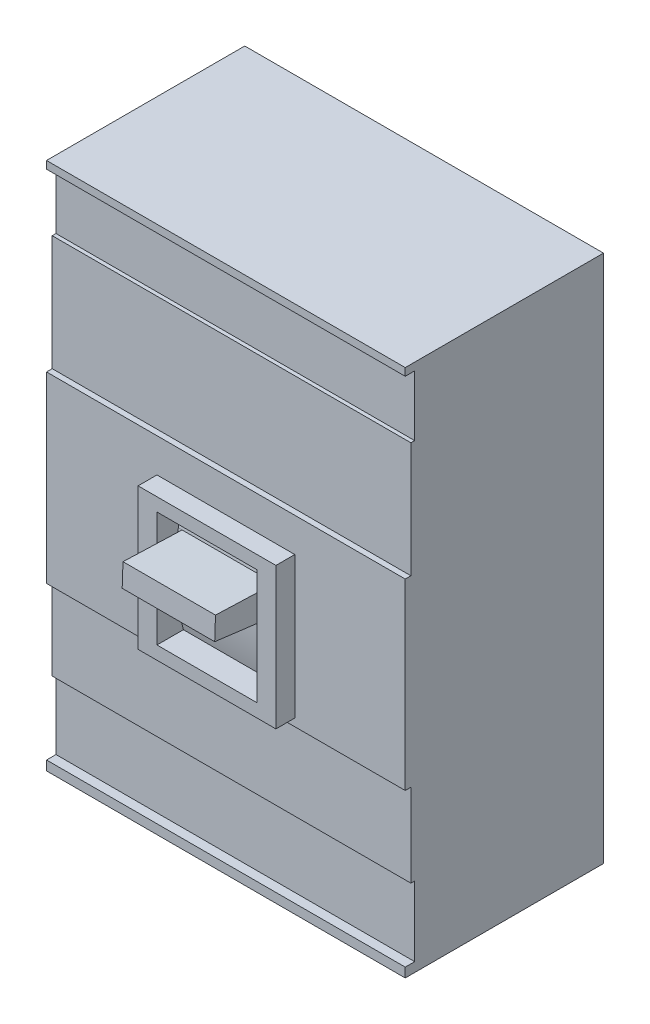
ISO-10303-21;
HEADER;
FILE_DESCRIPTION(('STEP AP214'),'2;1');
FILE_NAME('part.step','',(''),(''),'','','');
FILE_SCHEMA(('AUTOMOTIVE_DESIGN { 1 0 10303 214 1 1 1 1 }'));
ENDSEC;
DATA;
#1=APPLICATION_CONTEXT('core data for automotive mechanical design processes');
#2=APPLICATION_PROTOCOL_DEFINITION('international standard','automotive_design',2000,#1);
#3=PRODUCT_CONTEXT('',#1,'mechanical');
#4=PRODUCT('Part','Part','',(#3));
#5=PRODUCT_RELATED_PRODUCT_CATEGORY('part','',(#4));
#6=PRODUCT_DEFINITION_FORMATION('','',#4);
#7=PRODUCT_DEFINITION_CONTEXT('part definition',#1,'design');
#8=PRODUCT_DEFINITION('design','',#6,#7);
#9=PRODUCT_DEFINITION_SHAPE('','',#8);
#10=(LENGTH_UNIT() NAMED_UNIT(*) SI_UNIT(.MILLI.,.METRE.));
#11=(NAMED_UNIT(*) PLANE_ANGLE_UNIT() SI_UNIT($,.RADIAN.));
#12=(NAMED_UNIT(*) SI_UNIT($,.STERADIAN.) SOLID_ANGLE_UNIT());
#13=UNCERTAINTY_MEASURE_WITH_UNIT(LENGTH_MEASURE(1.E-05),#10,'distance_accuracy_value','');
#14=(GEOMETRIC_REPRESENTATION_CONTEXT(3) GLOBAL_UNCERTAINTY_ASSIGNED_CONTEXT((#13)) GLOBAL_UNIT_ASSIGNED_CONTEXT((#10,
#11,#12)) REPRESENTATION_CONTEXT('',''));
#15=CARTESIAN_POINT('',(0.,0.,0.));
#16=DIRECTION('',(0.,0.,1.));
#17=DIRECTION('',(1.,0.,0.));
#18=AXIS2_PLACEMENT_3D('',#15,#16,#17);
#19=CARTESIAN_POINT('',(0.,0.,105.));
#20=DIRECTION('',(0.,0.,-1.));
#21=DIRECTION('',(-1.,0.,0.));
#22=AXIS2_PLACEMENT_3D('',#19,#20,#21);
#23=PLANE('',#22);
#24=DIRECTION('',(0.,1.,0.));
#25=VECTOR('',#24,1.);
#26=CARTESIAN_POINT('',(36.5,-50.,105.));
#27=LINE('',#26,#25);
#28=CARTESIAN_POINT('',(36.5,-50.,105.));
#29=VERTEX_POINT('',#28);
#30=CARTESIAN_POINT('',(36.5,25.,105.));
#31=VERTEX_POINT('',#30);
#32=EDGE_CURVE('E394',#29,#31,#27,.T.);
#33=ORIENTED_EDGE('',*,*,#32,.F.);
#34=DIRECTION('',(1.,0.,0.));
#35=VECTOR('',#34,1.);
#36=CARTESIAN_POINT('',(-36.5,-50.,105.));
#37=LINE('',#36,#35);
#38=CARTESIAN_POINT('',(-36.5,-50.,105.));
#39=VERTEX_POINT('',#38);
#40=EDGE_CURVE('E399',#39,#29,#37,.T.);
#41=ORIENTED_EDGE('',*,*,#40,.F.);
#42=DIRECTION('',(0.,-1.,0.));
#43=VECTOR('',#42,1.);
#44=CARTESIAN_POINT('',(-36.5,-50.,105.));
#45=LINE('',#44,#43);
#46=CARTESIAN_POINT('',(-36.5,25.,105.));
#47=VERTEX_POINT('',#46);
#48=EDGE_CURVE('E411',#47,#39,#45,.T.);
#49=ORIENTED_EDGE('',*,*,#48,.F.);
#50=DIRECTION('',(-1.,0.,0.));
#51=VECTOR('',#50,1.);
#52=CARTESIAN_POINT('',(-36.5,25.,105.));
#53=LINE('',#52,#51);
#54=EDGE_CURVE('E408',#31,#47,#53,.T.);
#55=ORIENTED_EDGE('',*,*,#54,.F.);
#56=EDGE_LOOP('',(#33,#41,#49,#55));
#57=FACE_BOUND('',#56,.T.);
#58=DIRECTION('',(0.,-1.,0.));
#59=VECTOR('',#58,1.);
#60=CARTESIAN_POINT('',(-95.,-140.,105.));
#61=LINE('',#60,#59);
#62=CARTESIAN_POINT('',(-95.,43.,105.));
#63=VERTEX_POINT('',#62);
#64=CARTESIAN_POINT('',(-95.,-54.,105.));
#65=VERTEX_POINT('',#64);
#66=EDGE_CURVE('E439',#63,#65,#61,.T.);
#67=ORIENTED_EDGE('',*,*,#66,.T.);
#68=DIRECTION('',(-1.,0.,0.));
#69=VECTOR('',#68,1.);
#70=CARTESIAN_POINT('',(-95.,-54.,105.));
#71=LINE('',#70,#69);
#72=CARTESIAN_POINT('',(95.,-54.,105.));
#73=VERTEX_POINT('',#72);
#74=EDGE_CURVE('E266',#73,#65,#71,.T.);
#75=ORIENTED_EDGE('',*,*,#74,.F.);
#76=DIRECTION('',(0.,1.,0.));
#77=VECTOR('',#76,1.);
#78=CARTESIAN_POINT('',(95.,-140.,105.));
#79=LINE('',#78,#77);
#80=CARTESIAN_POINT('',(95.,43.,105.));
#81=VERTEX_POINT('',#80);
#82=EDGE_CURVE('E432',#73,#81,#79,.T.);
#83=ORIENTED_EDGE('',*,*,#82,.T.);
#84=DIRECTION('',(1.,0.,0.));
#85=VECTOR('',#84,1.);
#86=CARTESIAN_POINT('',(-95.,43.,105.));
#87=LINE('',#86,#85);
#88=EDGE_CURVE('E326',#63,#81,#87,.T.);
#89=ORIENTED_EDGE('',*,*,#88,.F.);
#90=EDGE_LOOP('',(#67,#75,#83,#89));
#91=FACE_BOUND('',#90,.T.);
#92=ADVANCED_FACE('F33',(#57,#91),#23,.F.);
#93=CARTESIAN_POINT('',(61.9789509041557,-5.78684414982676,135.421940476445));
#94=DIRECTION('',(0.,0.992095229402918,-0.125487273442257));
#95=DIRECTION('',(0.,0.125487273442257,0.992095229402918));
#96=AXIS2_PLACEMENT_3D('',#93,#94,#95);
#97=PLANE('',#96);
#98=DIRECTION('',(0.,0.125487273442257,0.992095229402918));
#99=VECTOR('',#98,1.);
#100=CARTESIAN_POINT('',(-24.5,-5.78684414982676,135.421940476445));
#101=LINE('',#100,#99);
#102=CARTESIAN_POINT('',(-24.5,-9.639204549284,104.965398793747));
#103=VERTEX_POINT('',#102);
#104=CARTESIAN_POINT('',(-24.5,-5.78684414982676,135.421940476445));
#105=VERTEX_POINT('',#104);
#106=EDGE_CURVE('E283',#103,#105,#101,.T.);
#107=ORIENTED_EDGE('',*,*,#106,.F.);
#108=DIRECTION('',(-1.,0.,0.));
#109=VECTOR('',#108,1.);
#110=CARTESIAN_POINT('',(61.9789509041557,-9.639204549284,104.965398793747));
#111=LINE('',#110,#109);
#112=CARTESIAN_POINT('',(24.5,-9.63920454928403,104.965398793747));
#113=VERTEX_POINT('',#112);
#114=EDGE_CURVE('E308',#113,#103,#111,.T.);
#115=ORIENTED_EDGE('',*,*,#114,.F.);
#116=DIRECTION('',(0.,-0.125487273442257,-0.992095229402918));
#117=VECTOR('',#116,1.);
#118=CARTESIAN_POINT('',(24.5,-5.78684414982676,135.421940476445));
#119=LINE('',#118,#117);
#120=CARTESIAN_POINT('',(24.5,-5.78684414982676,135.421940476445));
#121=VERTEX_POINT('',#120);
#122=EDGE_CURVE('E300',#121,#113,#119,.T.);
#123=ORIENTED_EDGE('',*,*,#122,.F.);
#124=DIRECTION('',(-1.,0.,0.));
#125=VECTOR('',#124,1.);
#126=CARTESIAN_POINT('',(61.9789509041557,-5.78684414982676,135.421940476445));
#127=LINE('',#126,#125);
#128=EDGE_CURVE('E313',#121,#105,#127,.T.);
#129=ORIENTED_EDGE('',*,*,#128,.T.);
#130=EDGE_LOOP('',(#107,#115,#123,#129));
#131=FACE_BOUND('',#130,.T.);
#132=ADVANCED_FACE('F500',(#131),#97,.F.);
#133=CARTESIAN_POINT('',(61.9789509041557,6.21315585017324,135.));
#134=DIRECTION('',(0.,-0.0351399904941883,-0.999382399819042));
#135=DIRECTION('',(0.,0.999382399819042,-0.0351399904941883));
#136=AXIS2_PLACEMENT_3D('',#133,#134,#135);
#137=PLANE('',#136);
#138=DIRECTION('',(0.,0.999382399819042,-0.0351399904941883));
#139=VECTOR('',#138,1.);
#140=CARTESIAN_POINT('',(-24.5,6.21315585017324,135.));
#141=LINE('',#140,#139);
#142=CARTESIAN_POINT('',(-24.5,6.21315585017324,135.));
#143=VERTEX_POINT('',#142);
#144=EDGE_CURVE('E285',#105,#143,#141,.T.);
#145=ORIENTED_EDGE('',*,*,#144,.F.);
#146=ORIENTED_EDGE('',*,*,#128,.F.);
#147=DIRECTION('',(0.,-0.999382399819042,0.0351399904941883));
#148=VECTOR('',#147,1.);
#149=CARTESIAN_POINT('',(24.5,6.21315585017324,135.));
#150=LINE('',#149,#148);
#151=CARTESIAN_POINT('',(24.5,6.21315585017324,135.));
#152=VERTEX_POINT('',#151);
#153=EDGE_CURVE('E298',#152,#121,#150,.T.);
#154=ORIENTED_EDGE('',*,*,#153,.F.);
#155=DIRECTION('',(-1.,0.,0.));
#156=VECTOR('',#155,1.);
#157=CARTESIAN_POINT('',(61.9789509041557,6.21315585017324,135.));
#158=LINE('',#157,#156);
#159=EDGE_CURVE('E316',#152,#143,#158,.T.);
#160=ORIENTED_EDGE('',*,*,#159,.T.);
#161=EDGE_LOOP('',(#145,#146,#154,#160));
#162=FACE_BOUND('',#161,.T.);
#163=ADVANCED_FACE('F506',(#162),#137,.F.);
#164=CARTESIAN_POINT('',(61.9789509041557,5.1119422513125,103.681451711695));
#165=DIRECTION('',(0.,-0.999382399819042,0.035139990494188));
#166=DIRECTION('',(0.,-0.035139990494188,-0.999382399819042));
#167=AXIS2_PLACEMENT_3D('',#164,#165,#166);
#168=PLANE('',#167);
#169=DIRECTION('',(0.,-0.035139990494188,-0.999382399819043));
#170=VECTOR('',#169,1.);
#171=CARTESIAN_POINT('',(-24.5,5.1119422513125,103.681451711695));
#172=LINE('',#171,#170);
#173=CARTESIAN_POINT('',(-24.5,5.1119422513125,103.681451711695));
#174=VERTEX_POINT('',#173);
#175=EDGE_CURVE('E287',#143,#174,#172,.T.);
#176=ORIENTED_EDGE('',*,*,#175,.F.);
#177=ORIENTED_EDGE('',*,*,#159,.F.);
#178=DIRECTION('',(0.,0.035139990494188,0.999382399819043));
#179=VECTOR('',#178,1.);
#180=CARTESIAN_POINT('',(24.5,6.21315585017324,135.));
#181=LINE('',#180,#179);
#182=CARTESIAN_POINT('',(24.5,5.1119422513125,103.681451711695));
#183=VERTEX_POINT('',#182);
#184=EDGE_CURVE('E306',#183,#152,#181,.T.);
#185=ORIENTED_EDGE('',*,*,#184,.F.);
#186=DIRECTION('',(-1.,0.,0.));
#187=VECTOR('',#186,1.);
#188=CARTESIAN_POINT('',(61.9789509041557,5.1119422513125,103.681451711695));
#189=LINE('',#188,#187);
#190=EDGE_CURVE('E319',#183,#174,#189,.T.);
#191=ORIENTED_EDGE('',*,*,#190,.T.);
#192=EDGE_LOOP('',(#176,#177,#185,#191));
#193=FACE_BOUND('',#192,.T.);
#194=ADVANCED_FACE('F528',(#193),#168,.F.);
#195=CARTESIAN_POINT('',(26.5,-43.,115.));
#196=DIRECTION('',(-1.,0.,0.));
#197=DIRECTION('',(0.,0.,1.));
#198=AXIS2_PLACEMENT_3D('',#195,#196,#197);
#199=PLANE('',#198);
#200=CARTESIAN_POINT('',(26.5,-12.5,-13.2812499999996));
#201=DIRECTION('',(-1.,0.,0.));
#202=DIRECTION('',(0.,0.,1.));
#203=AXIS2_PLACEMENT_3D('',#200,#201,#202);
#204=CIRCLE('',#203,118.28125);
#205=CARTESIAN_POINT('',(26.5,18.,101.));
#206=VERTEX_POINT('',#205);
#207=CARTESIAN_POINT('',(26.5,5.1119422513125,103.681451711695));
#208=VERTEX_POINT('',#207);
#209=EDGE_CURVE('E323',#206,#208,#204,.F.);
#210=ORIENTED_EDGE('',*,*,#209,.T.);
#211=CARTESIAN_POINT('',(26.5,-9.44534294077746,21.813416545032));
#212=DIRECTION('',(-1.,0.,0.));
#213=DIRECTION('',(0.,0.,1.));
#214=AXIS2_PLACEMENT_3D('',#211,#212,#213);
#215=CIRCLE('',#214,83.1522082341401);
#216=CARTESIAN_POINT('',(26.5,-9.63920454928403,104.965398793747));
#217=VERTEX_POINT('',#216);
#218=EDGE_CURVE('E295',#217,#208,#215,.T.);
#219=ORIENTED_EDGE('',*,*,#218,.F.);
#220=CARTESIAN_POINT('',(26.5,-43.0000000000001,101.));
#221=VERTEX_POINT('',#220);
#222=EDGE_CURVE('E327',#217,#221,#204,.F.);
#223=ORIENTED_EDGE('',*,*,#222,.T.);
#224=DIRECTION('',(0.,0.,-1.));
#225=VECTOR('',#224,1.);
#226=CARTESIAN_POINT('',(26.5,-43.,115.));
#227=LINE('',#226,#225);
#228=CARTESIAN_POINT('',(26.5,-43.,115.));
#229=VERTEX_POINT('',#228);
#230=EDGE_CURVE('E383',#229,#221,#227,.T.);
#231=ORIENTED_EDGE('',*,*,#230,.F.);
#232=DIRECTION('',(0.,1.,0.));
#233=VECTOR('',#232,1.);
#234=CARTESIAN_POINT('',(26.5,-43.,115.));
#235=LINE('',#234,#233);
#236=CARTESIAN_POINT('',(26.5,18.,115.));
#237=VERTEX_POINT('',#236);
#238=EDGE_CURVE('E368',#229,#237,#235,.T.);
#239=ORIENTED_EDGE('',*,*,#238,.T.);
#240=DIRECTION('',(0.,0.,-1.));
#241=VECTOR('',#240,1.);
#242=CARTESIAN_POINT('',(26.5,18.,115.));
#243=LINE('',#242,#241);
#244=EDGE_CURVE('E391',#237,#206,#243,.T.);
#245=ORIENTED_EDGE('',*,*,#244,.T.);
#246=EDGE_LOOP('',(#210,#219,#223,#231,#239,#245));
#247=FACE_BOUND('',#246,.T.);
#248=ADVANCED_FACE('F557',(#247),#199,.T.);
#249=CARTESIAN_POINT('',(-26.5,-43.,115.));
#250=DIRECTION('',(1.,0.,0.));
#251=DIRECTION('',(0.,0.,-1.));
#252=AXIS2_PLACEMENT_3D('',#249,#250,#251);
#253=PLANE('',#252);
#254=DIRECTION('',(0.,-1.,0.));
#255=VECTOR('',#254,1.);
#256=CARTESIAN_POINT('',(-26.5,-43.,115.));
#257=LINE('',#256,#255);
#258=CARTESIAN_POINT('',(-26.5,18.,115.));
#259=VERTEX_POINT('',#258);
#260=CARTESIAN_POINT('',(-26.5,-43.,115.));
#261=VERTEX_POINT('',#260);
#262=EDGE_CURVE('E379',#259,#261,#257,.T.);
#263=ORIENTED_EDGE('',*,*,#262,.T.);
#264=DIRECTION('',(0.,0.,-1.));
#265=VECTOR('',#264,1.);
#266=CARTESIAN_POINT('',(-26.5,-43.,115.));
#267=LINE('',#266,#265);
#268=CARTESIAN_POINT('',(-26.5,-43.0000000000001,101.));
#269=VERTEX_POINT('',#268);
#270=EDGE_CURVE('E386',#261,#269,#267,.T.);
#271=ORIENTED_EDGE('',*,*,#270,.T.);
#272=CARTESIAN_POINT('',(-26.5,-12.5,-13.2812499999996));
#273=DIRECTION('',(-1.,0.,0.));
#274=DIRECTION('',(0.,0.,1.));
#275=AXIS2_PLACEMENT_3D('',#272,#273,#274);
#276=CIRCLE('',#275,118.28125);
#277=CARTESIAN_POINT('',(-26.5,-9.639204549284,104.965398793747));
#278=VERTEX_POINT('',#277);
#279=EDGE_CURVE('E328',#269,#278,#276,.T.);
#280=ORIENTED_EDGE('',*,*,#279,.T.);
#281=CARTESIAN_POINT('',(-26.5,-9.44534294078339,21.8134165449638));
#282=DIRECTION('',(1.,0.,0.));
#283=DIRECTION('',(0.,0.,1.));
#284=AXIS2_PLACEMENT_3D('',#281,#282,#283);
#285=CIRCLE('',#284,83.1522082342083);
#286=CARTESIAN_POINT('',(-26.5,5.1119422513125,103.681451711695));
#287=VERTEX_POINT('',#286);
#288=EDGE_CURVE('E278',#287,#278,#285,.T.);
#289=ORIENTED_EDGE('',*,*,#288,.F.);
#290=CARTESIAN_POINT('',(-26.5,18.,101.));
#291=VERTEX_POINT('',#290);
#292=EDGE_CURVE('E322',#287,#291,#276,.T.);
#293=ORIENTED_EDGE('',*,*,#292,.T.);
#294=DIRECTION('',(0.,0.,-1.));
#295=VECTOR('',#294,1.);
#296=CARTESIAN_POINT('',(-26.5,18.,115.));
#297=LINE('',#296,#295);
#298=EDGE_CURVE('E388',#259,#291,#297,.T.);
#299=ORIENTED_EDGE('',*,*,#298,.F.);
#300=EDGE_LOOP('',(#263,#271,#280,#289,#293,#299));
#301=FACE_BOUND('',#300,.T.);
#302=ADVANCED_FACE('F523',(#301),#253,.T.);
#303=CARTESIAN_POINT('',(87.8935274010137,-12.5,-13.2812499999996));
#304=DIRECTION('',(-1.,0.,0.));
#305=DIRECTION('',(0.,0.,1.));
#306=AXIS2_PLACEMENT_3D('',#303,#304,#305);
#307=CYLINDRICAL_SURFACE('',#306,118.28125);
#308=ORIENTED_EDGE('',*,*,#222,.F.);
#309=EDGE_CURVE('E310',#217,#113,#111,.T.);
#310=ORIENTED_EDGE('',*,*,#309,.T.);
#311=ORIENTED_EDGE('',*,*,#114,.T.);
#312=DIRECTION('',(-1.,0.,0.));
#313=VECTOR('',#312,1.);
#314=CARTESIAN_POINT('',(-24.5,-9.639204549284,104.965398793747));
#315=LINE('',#314,#313);
#316=EDGE_CURVE('E290',#103,#278,#315,.T.);
#317=ORIENTED_EDGE('',*,*,#316,.T.);
#318=ORIENTED_EDGE('',*,*,#279,.F.);
#319=DIRECTION('',(-1.,0.,0.));
#320=VECTOR('',#319,1.);
#321=CARTESIAN_POINT('',(87.8935274010137,-43.0000000000001,101.));
#322=LINE('',#321,#320);
#323=EDGE_CURVE('E334',#221,#269,#322,.T.);
#324=ORIENTED_EDGE('',*,*,#323,.F.);
#325=EDGE_LOOP('',(#308,#310,#311,#317,#318,#324));
#326=FACE_BOUND('',#325,.T.);
#327=ADVANCED_FACE('F517',(#326),#307,.T.);
#328=ORIENTED_EDGE('',*,*,#292,.F.);
#329=DIRECTION('',(-1.,0.,0.));
#330=VECTOR('',#329,1.);
#331=CARTESIAN_POINT('',(-24.5,5.1119422513125,103.681451711695));
#332=LINE('',#331,#330);
#333=EDGE_CURVE('E292',#174,#287,#332,.T.);
#334=ORIENTED_EDGE('',*,*,#333,.F.);
#335=ORIENTED_EDGE('',*,*,#190,.F.);
#336=EDGE_CURVE('E320',#208,#183,#189,.T.);
#337=ORIENTED_EDGE('',*,*,#336,.F.);
#338=ORIENTED_EDGE('',*,*,#209,.F.);
#339=DIRECTION('',(-1.,0.,0.));
#340=VECTOR('',#339,1.);
#341=CARTESIAN_POINT('',(87.8935274010137,18.,101.));
#342=LINE('',#341,#340);
#343=EDGE_CURVE('E331',#206,#291,#342,.T.);
#344=ORIENTED_EDGE('',*,*,#343,.T.);
#345=EDGE_LOOP('',(#328,#334,#335,#337,#338,#344));
#346=FACE_BOUND('',#345,.T.);
#347=ADVANCED_FACE('F513',(#346),#307,.T.);
#348=CARTESIAN_POINT('',(-95.,140.,105.));
#349=VERTEX_POINT('',#348);
#350=CARTESIAN_POINT('',(-95.,136.,105.));
#351=VERTEX_POINT('',#350);
#352=EDGE_CURVE('E435',#349,#351,#61,.T.);
#353=ORIENTED_EDGE('',*,*,#352,.T.);
#354=DIRECTION('',(-1.,0.,0.));
#355=VECTOR('',#354,1.);
#356=CARTESIAN_POINT('',(-95.,136.,105.));
#357=LINE('',#356,#355);
#358=CARTESIAN_POINT('',(95.,136.,105.));
#359=VERTEX_POINT('',#358);
#360=EDGE_CURVE('E351',#359,#351,#357,.T.);
#361=ORIENTED_EDGE('',*,*,#360,.F.);
#362=CARTESIAN_POINT('',(95.,140.,105.));
#363=VERTEX_POINT('',#362);
#364=EDGE_CURVE('E433',#359,#363,#79,.T.);
#365=ORIENTED_EDGE('',*,*,#364,.T.);
#366=DIRECTION('',(-1.,0.,0.));
#367=VECTOR('',#366,1.);
#368=CARTESIAN_POINT('',(-95.,140.,105.));
#369=LINE('',#368,#367);
#370=EDGE_CURVE('E431',#363,#349,#369,.T.);
#371=ORIENTED_EDGE('',*,*,#370,.T.);
#372=EDGE_LOOP('',(#353,#361,#365,#371));
#373=FACE_BOUND('',#372,.T.);
#374=ADVANCED_FACE('F490',(#373),#23,.F.);
#375=CARTESIAN_POINT('',(95.,-140.,105.));
#376=VERTEX_POINT('',#375);
#377=CARTESIAN_POINT('',(95.,-135.,105.));
#378=VERTEX_POINT('',#377);
#379=EDGE_CURVE('E428',#376,#378,#79,.T.);
#380=ORIENTED_EDGE('',*,*,#379,.T.);
#381=DIRECTION('',(1.,0.,0.));
#382=VECTOR('',#381,1.);
#383=CARTESIAN_POINT('',(-95.,-135.,105.));
#384=LINE('',#383,#382);
#385=CARTESIAN_POINT('',(-95.,-135.,105.));
#386=VERTEX_POINT('',#385);
#387=EDGE_CURVE('E251',#386,#378,#384,.T.);
#388=ORIENTED_EDGE('',*,*,#387,.F.);
#389=CARTESIAN_POINT('',(-95.,-140.,105.));
#390=VERTEX_POINT('',#389);
#391=EDGE_CURVE('E256',#386,#390,#61,.T.);
#392=ORIENTED_EDGE('',*,*,#391,.T.);
#393=DIRECTION('',(1.,0.,0.));
#394=VECTOR('',#393,1.);
#395=CARTESIAN_POINT('',(-95.,-140.,105.));
#396=LINE('',#395,#394);
#397=EDGE_CURVE('E438',#390,#376,#396,.T.);
#398=ORIENTED_EDGE('',*,*,#397,.T.);
#399=EDGE_LOOP('',(#380,#388,#392,#398));
#400=FACE_BOUND('',#399,.T.);
#401=ADVANCED_FACE('F473',(#400),#23,.F.);
#402=CARTESIAN_POINT('',(95.,-140.,105.));
#403=DIRECTION('',(-1.,0.,0.));
#404=DIRECTION('',(0.,0.,1.));
#405=AXIS2_PLACEMENT_3D('',#402,#403,#404);
#406=PLANE('',#405);
#407=DIRECTION('',(0.,1.,0.));
#408=VECTOR('',#407,1.);
#409=CARTESIAN_POINT('',(95.,-98.,102.));
#410=LINE('',#409,#408);
#411=CARTESIAN_POINT('',(95.,-98.,102.));
#412=VERTEX_POINT('',#411);
#413=CARTESIAN_POINT('',(95.,-54.,102.));
#414=VERTEX_POINT('',#413);
#415=EDGE_CURVE('E269',#412,#414,#410,.T.);
#416=ORIENTED_EDGE('',*,*,#415,.F.);
#417=DIRECTION('',(0.,0.,1.));
#418=VECTOR('',#417,1.);
#419=CARTESIAN_POINT('',(95.,-98.,100.));
#420=LINE('',#419,#418);
#421=CARTESIAN_POINT('',(95.,-98.,100.));
#422=VERTEX_POINT('',#421);
#423=EDGE_CURVE('E258',#422,#412,#420,.T.);
#424=ORIENTED_EDGE('',*,*,#423,.F.);
#425=DIRECTION('',(0.,1.,0.));
#426=VECTOR('',#425,1.);
#427=CARTESIAN_POINT('',(95.,-135.,100.));
#428=LINE('',#427,#426);
#429=CARTESIAN_POINT('',(95.,-135.,100.));
#430=VERTEX_POINT('',#429);
#431=EDGE_CURVE('E241',#430,#422,#428,.T.);
#432=ORIENTED_EDGE('',*,*,#431,.F.);
#433=DIRECTION('',(0.,0.,1.));
#434=VECTOR('',#433,1.);
#435=CARTESIAN_POINT('',(95.,-135.,100.));
#436=LINE('',#435,#434);
#437=EDGE_CURVE('E238',#430,#378,#436,.T.);
#438=ORIENTED_EDGE('',*,*,#437,.T.);
#439=ORIENTED_EDGE('',*,*,#379,.F.);
#440=DIRECTION('',(0.,0.,-1.));
#441=VECTOR('',#440,1.);
#442=CARTESIAN_POINT('',(95.,-140.,105.));
#443=LINE('',#442,#441);
#444=CARTESIAN_POINT('',(95.,-140.,0.));
#445=VERTEX_POINT('',#444);
#446=EDGE_CURVE('E441',#376,#445,#443,.T.);
#447=ORIENTED_EDGE('',*,*,#446,.T.);
#448=DIRECTION('',(0.,1.,0.));
#449=VECTOR('',#448,1.);
#450=CARTESIAN_POINT('',(95.,-140.,0.));
#451=LINE('',#450,#449);
#452=CARTESIAN_POINT('',(95.,140.,0.));
#453=VERTEX_POINT('',#452);
#454=EDGE_CURVE('E427',#445,#453,#451,.T.);
#455=ORIENTED_EDGE('',*,*,#454,.T.);
#456=DIRECTION('',(0.,0.,-1.));
#457=VECTOR('',#456,1.);
#458=CARTESIAN_POINT('',(95.,140.,105.));
#459=LINE('',#458,#457);
#460=EDGE_CURVE('E11',#363,#453,#459,.T.);
#461=ORIENTED_EDGE('',*,*,#460,.F.);
#462=ORIENTED_EDGE('',*,*,#364,.F.);
#463=DIRECTION('',(0.,0.,1.));
#464=VECTOR('',#463,1.);
#465=CARTESIAN_POINT('',(95.,136.,100.));
#466=LINE('',#465,#464);
#467=CARTESIAN_POINT('',(95.,136.,100.));
#468=VERTEX_POINT('',#467);
#469=EDGE_CURVE('E369',#468,#359,#466,.T.);
#470=ORIENTED_EDGE('',*,*,#469,.F.);
#471=DIRECTION('',(0.,1.,0.));
#472=VECTOR('',#471,1.);
#473=CARTESIAN_POINT('',(95.,136.,100.));
#474=LINE('',#473,#472);
#475=CARTESIAN_POINT('',(95.,104.,100.));
#476=VERTEX_POINT('',#475);
#477=EDGE_CURVE('E359',#476,#468,#474,.T.);
#478=ORIENTED_EDGE('',*,*,#477,.F.);
#479=DIRECTION('',(0.,0.,1.));
#480=VECTOR('',#479,1.);
#481=CARTESIAN_POINT('',(95.,104.,100.));
#482=LINE('',#481,#480);
#483=CARTESIAN_POINT('',(95.,104.,102.));
#484=VERTEX_POINT('',#483);
#485=EDGE_CURVE('E371',#476,#484,#482,.T.);
#486=ORIENTED_EDGE('',*,*,#485,.T.);
#487=DIRECTION('',(0.,1.,0.));
#488=VECTOR('',#487,1.);
#489=CARTESIAN_POINT('',(95.,104.,102.));
#490=LINE('',#489,#488);
#491=CARTESIAN_POINT('',(95.,43.,102.));
#492=VERTEX_POINT('',#491);
#493=EDGE_CURVE('E56',#492,#484,#490,.T.);
#494=ORIENTED_EDGE('',*,*,#493,.F.);
#495=DIRECTION('',(0.,0.,1.));
#496=VECTOR('',#495,1.);
#497=CARTESIAN_POINT('',(95.,43.,102.));
#498=LINE('',#497,#496);
#499=EDGE_CURVE('E348',#492,#81,#498,.T.);
#500=ORIENTED_EDGE('',*,*,#499,.T.);
#501=ORIENTED_EDGE('',*,*,#82,.F.);
#502=DIRECTION('',(0.,0.,1.));
#503=VECTOR('',#502,1.);
#504=CARTESIAN_POINT('',(95.,-54.,102.));
#505=LINE('',#504,#503);
#506=EDGE_CURVE('E272',#414,#73,#505,.T.);
#507=ORIENTED_EDGE('',*,*,#506,.F.);
#508=EDGE_LOOP('',(#416,#424,#432,#438,#439,#447,#455,#461,#462,#470,#478,#486,#494,#500,#501,#507));
#509=FACE_BOUND('',#508,.T.);
#510=ADVANCED_FACE('F35',(#509),#406,.F.);
#511=CARTESIAN_POINT('',(-95.,140.,105.));
#512=DIRECTION('',(0.,-1.,0.));
#513=DIRECTION('',(0.,0.,-1.));
#514=AXIS2_PLACEMENT_3D('',#511,#512,#513);
#515=PLANE('',#514);
#516=DIRECTION('',(-1.,0.,0.));
#517=VECTOR('',#516,1.);
#518=CARTESIAN_POINT('',(-95.,140.,0.));
#519=LINE('',#518,#517);
#520=CARTESIAN_POINT('',(-95.,140.,0.));
#521=VERTEX_POINT('',#520);
#522=EDGE_CURVE('E444',#453,#521,#519,.T.);
#523=ORIENTED_EDGE('',*,*,#522,.T.);
#524=DIRECTION('',(0.,0.,-1.));
#525=VECTOR('',#524,1.);
#526=CARTESIAN_POINT('',(-95.,140.,105.));
#527=LINE('',#526,#525);
#528=EDGE_CURVE('E41',#349,#521,#527,.T.);
#529=ORIENTED_EDGE('',*,*,#528,.F.);
#530=ORIENTED_EDGE('',*,*,#370,.F.);
#531=ORIENTED_EDGE('',*,*,#460,.T.);
#532=EDGE_LOOP('',(#523,#529,#530,#531));
#533=FACE_BOUND('',#532,.T.);
#534=ADVANCED_FACE('F492',(#533),#515,.F.);
#535=CARTESIAN_POINT('',(-95.,-140.,105.));
#536=DIRECTION('',(1.,0.,0.));
#537=DIRECTION('',(0.,0.,-1.));
#538=AXIS2_PLACEMENT_3D('',#535,#536,#537);
#539=PLANE('',#538);
#540=DIRECTION('',(0.,-1.,0.));
#541=VECTOR('',#540,1.);
#542=CARTESIAN_POINT('',(-95.,-98.,100.));
#543=LINE('',#542,#541);
#544=CARTESIAN_POINT('',(-95.,-98.,100.));
#545=VERTEX_POINT('',#544);
#546=CARTESIAN_POINT('',(-95.,-135.,100.));
#547=VERTEX_POINT('',#546);
#548=EDGE_CURVE('E242',#545,#547,#543,.T.);
#549=ORIENTED_EDGE('',*,*,#548,.F.);
#550=DIRECTION('',(0.,0.,1.));
#551=VECTOR('',#550,1.);
#552=CARTESIAN_POINT('',(-95.,-98.,100.));
#553=LINE('',#552,#551);
#554=CARTESIAN_POINT('',(-95.,-98.,102.));
#555=VERTEX_POINT('',#554);
#556=EDGE_CURVE('E274',#545,#555,#553,.T.);
#557=ORIENTED_EDGE('',*,*,#556,.T.);
#558=DIRECTION('',(0.,-1.,0.));
#559=VECTOR('',#558,1.);
#560=CARTESIAN_POINT('',(-95.,-54.,102.));
#561=LINE('',#560,#559);
#562=CARTESIAN_POINT('',(-95.,-54.,102.));
#563=VERTEX_POINT('',#562);
#564=EDGE_CURVE('E263',#563,#555,#561,.T.);
#565=ORIENTED_EDGE('',*,*,#564,.F.);
#566=DIRECTION('',(0.,0.,1.));
#567=VECTOR('',#566,1.);
#568=CARTESIAN_POINT('',(-95.,-54.,102.));
#569=LINE('',#568,#567);
#570=EDGE_CURVE('E275',#563,#65,#569,.T.);
#571=ORIENTED_EDGE('',*,*,#570,.T.);
#572=ORIENTED_EDGE('',*,*,#66,.F.);
#573=DIRECTION('',(0.,0.,1.));
#574=VECTOR('',#573,1.);
#575=CARTESIAN_POINT('',(-95.,43.,102.));
#576=LINE('',#575,#574);
#577=CARTESIAN_POINT('',(-95.,43.,102.));
#578=VERTEX_POINT('',#577);
#579=EDGE_CURVE('E345',#578,#63,#576,.T.);
#580=ORIENTED_EDGE('',*,*,#579,.F.);
#581=DIRECTION('',(0.,-1.,0.));
#582=VECTOR('',#581,1.);
#583=CARTESIAN_POINT('',(-95.,43.,102.));
#584=LINE('',#583,#582);
#585=CARTESIAN_POINT('',(-95.,104.,102.));
#586=VERTEX_POINT('',#585);
#587=EDGE_CURVE('E337',#586,#578,#584,.T.);
#588=ORIENTED_EDGE('',*,*,#587,.F.);
#589=DIRECTION('',(0.,0.,1.));
#590=VECTOR('',#589,1.);
#591=CARTESIAN_POINT('',(-95.,104.,100.));
#592=LINE('',#591,#590);
#593=CARTESIAN_POINT('',(-95.,104.,100.));
#594=VERTEX_POINT('',#593);
#595=EDGE_CURVE('E363',#594,#586,#592,.T.);
#596=ORIENTED_EDGE('',*,*,#595,.F.);
#597=DIRECTION('',(0.,-1.,0.));
#598=VECTOR('',#597,1.);
#599=CARTESIAN_POINT('',(-95.,104.,100.));
#600=LINE('',#599,#598);
#601=CARTESIAN_POINT('',(-95.,136.,100.));
#602=VERTEX_POINT('',#601);
#603=EDGE_CURVE('E353',#602,#594,#600,.T.);
#604=ORIENTED_EDGE('',*,*,#603,.F.);
#605=DIRECTION('',(0.,0.,1.));
#606=VECTOR('',#605,1.);
#607=CARTESIAN_POINT('',(-95.,136.,100.));
#608=LINE('',#607,#606);
#609=EDGE_CURVE('E365',#602,#351,#608,.T.);
#610=ORIENTED_EDGE('',*,*,#609,.T.);
#611=ORIENTED_EDGE('',*,*,#352,.F.);
#612=ORIENTED_EDGE('',*,*,#528,.T.);
#613=DIRECTION('',(0.,-1.,0.));
#614=VECTOR('',#613,1.);
#615=CARTESIAN_POINT('',(-95.,-140.,0.));
#616=LINE('',#615,#614);
#617=CARTESIAN_POINT('',(-95.,-140.,0.));
#618=VERTEX_POINT('',#617);
#619=EDGE_CURVE('E446',#521,#618,#616,.T.);
#620=ORIENTED_EDGE('',*,*,#619,.T.);
#621=DIRECTION('',(0.,0.,-1.));
#622=VECTOR('',#621,1.);
#623=CARTESIAN_POINT('',(-95.,-140.,105.));
#624=LINE('',#623,#622);
#625=EDGE_CURVE('E452',#390,#618,#624,.T.);
#626=ORIENTED_EDGE('',*,*,#625,.F.);
#627=ORIENTED_EDGE('',*,*,#391,.F.);
#628=DIRECTION('',(0.,0.,1.));
#629=VECTOR('',#628,1.);
#630=CARTESIAN_POINT('',(-95.,-135.,100.));
#631=LINE('',#630,#629);
#632=EDGE_CURVE('E235',#547,#386,#631,.T.);
#633=ORIENTED_EDGE('',*,*,#632,.F.);
#634=EDGE_LOOP('',(#549,#557,#565,#571,#572,#580,#588,#596,#604,#610,#611,#612,#620,#626,#627,#633));
#635=FACE_BOUND('',#634,.T.);
#636=ADVANCED_FACE('F254',(#635),#539,.F.);
#637=CARTESIAN_POINT('',(-95.,-140.,105.));
#638=DIRECTION('',(0.,1.,0.));
#639=DIRECTION('',(0.,0.,1.));
#640=AXIS2_PLACEMENT_3D('',#637,#638,#639);
#641=PLANE('',#640);
#642=DIRECTION('',(1.,0.,0.));
#643=VECTOR('',#642,1.);
#644=CARTESIAN_POINT('',(-95.,-140.,0.));
#645=LINE('',#644,#643);
#646=EDGE_CURVE('E448',#618,#445,#645,.T.);
#647=ORIENTED_EDGE('',*,*,#646,.T.);
#648=ORIENTED_EDGE('',*,*,#446,.F.);
#649=ORIENTED_EDGE('',*,*,#397,.F.);
#650=ORIENTED_EDGE('',*,*,#625,.T.);
#651=EDGE_LOOP('',(#647,#648,#649,#650));
#652=FACE_BOUND('',#651,.T.);
#653=ADVANCED_FACE('F466',(#652),#641,.F.);
#654=CARTESIAN_POINT('',(0.,0.,0.));
#655=DIRECTION('',(0.,0.,-1.));
#656=DIRECTION('',(-1.,0.,0.));
#657=AXIS2_PLACEMENT_3D('',#654,#655,#656);
#658=PLANE('',#657);
#659=ORIENTED_EDGE('',*,*,#454,.F.);
#660=ORIENTED_EDGE('',*,*,#646,.F.);
#661=ORIENTED_EDGE('',*,*,#619,.F.);
#662=ORIENTED_EDGE('',*,*,#522,.F.);
#663=EDGE_LOOP('',(#659,#660,#661,#662));
#664=FACE_BOUND('',#663,.T.);
#665=ADVANCED_FACE('F463',(#664),#658,.T.);
#666=CARTESIAN_POINT('',(0.,0.,115.));
#667=DIRECTION('',(0.,0.,-1.));
#668=DIRECTION('',(-1.,0.,0.));
#669=AXIS2_PLACEMENT_3D('',#666,#667,#668);
#670=PLANE('',#669);
#671=DIRECTION('',(0.,1.,0.));
#672=VECTOR('',#671,1.);
#673=CARTESIAN_POINT('',(36.5,-50.,115.));
#674=LINE('',#673,#672);
#675=CARTESIAN_POINT('',(36.5,-50.,115.));
#676=VERTEX_POINT('',#675);
#677=CARTESIAN_POINT('',(36.5,25.,115.));
#678=VERTEX_POINT('',#677);
#679=EDGE_CURVE('E395',#676,#678,#674,.T.);
#680=ORIENTED_EDGE('',*,*,#679,.T.);
#681=DIRECTION('',(-1.,0.,0.));
#682=VECTOR('',#681,1.);
#683=CARTESIAN_POINT('',(-36.5,25.,115.));
#684=LINE('',#683,#682);
#685=CARTESIAN_POINT('',(-36.5,25.,115.));
#686=VERTEX_POINT('',#685);
#687=EDGE_CURVE('E398',#678,#686,#684,.T.);
#688=ORIENTED_EDGE('',*,*,#687,.T.);
#689=DIRECTION('',(0.,-1.,0.));
#690=VECTOR('',#689,1.);
#691=CARTESIAN_POINT('',(-36.5,-50.,115.));
#692=LINE('',#691,#690);
#693=CARTESIAN_POINT('',(-36.5,-50.,115.));
#694=VERTEX_POINT('',#693);
#695=EDGE_CURVE('E401',#686,#694,#692,.T.);
#696=ORIENTED_EDGE('',*,*,#695,.T.);
#697=DIRECTION('',(1.,0.,0.));
#698=VECTOR('',#697,1.);
#699=CARTESIAN_POINT('',(-36.5,-50.,115.));
#700=LINE('',#699,#698);
#701=EDGE_CURVE('E403',#694,#676,#700,.T.);
#702=ORIENTED_EDGE('',*,*,#701,.T.);
#703=EDGE_LOOP('',(#680,#688,#696,#702));
#704=FACE_BOUND('',#703,.T.);
#705=ORIENTED_EDGE('',*,*,#238,.F.);
#706=DIRECTION('',(1.,0.,0.));
#707=VECTOR('',#706,1.);
#708=CARTESIAN_POINT('',(-26.5,-43.,115.));
#709=LINE('',#708,#707);
#710=EDGE_CURVE('E381',#261,#229,#709,.T.);
#711=ORIENTED_EDGE('',*,*,#710,.F.);
#712=ORIENTED_EDGE('',*,*,#262,.F.);
#713=DIRECTION('',(-1.,0.,0.));
#714=VECTOR('',#713,1.);
#715=CARTESIAN_POINT('',(-26.5,18.,115.));
#716=LINE('',#715,#714);
#717=EDGE_CURVE('E377',#237,#259,#716,.T.);
#718=ORIENTED_EDGE('',*,*,#717,.F.);
#719=EDGE_LOOP('',(#705,#711,#712,#718));
#720=FACE_BOUND('',#719,.T.);
#721=ADVANCED_FACE('F566',(#704,#720),#670,.F.);
#722=CARTESIAN_POINT('',(36.5,-50.,115.));
#723=DIRECTION('',(-1.,0.,0.));
#724=DIRECTION('',(0.,-1.,0.));
#725=AXIS2_PLACEMENT_3D('',#722,#723,#724);
#726=PLANE('',#725);
#727=ORIENTED_EDGE('',*,*,#32,.T.);
#728=DIRECTION('',(0.,0.,-1.));
#729=VECTOR('',#728,1.);
#730=CARTESIAN_POINT('',(36.5,25.,115.));
#731=LINE('',#730,#729);
#732=EDGE_CURVE('E424',#678,#31,#731,.T.);
#733=ORIENTED_EDGE('',*,*,#732,.F.);
#734=ORIENTED_EDGE('',*,*,#679,.F.);
#735=DIRECTION('',(0.,0.,-1.));
#736=VECTOR('',#735,1.);
#737=CARTESIAN_POINT('',(36.5,-50.,115.));
#738=LINE('',#737,#736);
#739=EDGE_CURVE('E405',#676,#29,#738,.T.);
#740=ORIENTED_EDGE('',*,*,#739,.T.);
#741=EDGE_LOOP('',(#727,#733,#734,#740));
#742=FACE_BOUND('',#741,.T.);
#743=ADVANCED_FACE('F569',(#742),#726,.F.);
#744=CARTESIAN_POINT('',(-36.5,25.,115.));
#745=DIRECTION('',(0.,-1.,0.));
#746=DIRECTION('',(0.,0.,-1.));
#747=AXIS2_PLACEMENT_3D('',#744,#745,#746);
#748=PLANE('',#747);
#749=ORIENTED_EDGE('',*,*,#54,.T.);
#750=DIRECTION('',(0.,0.,-1.));
#751=VECTOR('',#750,1.);
#752=CARTESIAN_POINT('',(-36.5,25.,115.));
#753=LINE('',#752,#751);
#754=EDGE_CURVE('E421',#686,#47,#753,.T.);
#755=ORIENTED_EDGE('',*,*,#754,.F.);
#756=ORIENTED_EDGE('',*,*,#687,.F.);
#757=ORIENTED_EDGE('',*,*,#732,.T.);
#758=EDGE_LOOP('',(#749,#755,#756,#757));
#759=FACE_BOUND('',#758,.T.);
#760=ADVANCED_FACE('F577',(#759),#748,.F.);
#761=CARTESIAN_POINT('',(-36.5,-50.,115.));
#762=DIRECTION('',(1.,0.,0.));
#763=DIRECTION('',(0.,1.,0.));
#764=AXIS2_PLACEMENT_3D('',#761,#762,#763);
#765=PLANE('',#764);
#766=ORIENTED_EDGE('',*,*,#48,.T.);
#767=DIRECTION('',(0.,0.,-1.));
#768=VECTOR('',#767,1.);
#769=CARTESIAN_POINT('',(-36.5,-50.,115.));
#770=LINE('',#769,#768);
#771=EDGE_CURVE('E418',#694,#39,#770,.T.);
#772=ORIENTED_EDGE('',*,*,#771,.F.);
#773=ORIENTED_EDGE('',*,*,#695,.F.);
#774=ORIENTED_EDGE('',*,*,#754,.T.);
#775=EDGE_LOOP('',(#766,#772,#773,#774));
#776=FACE_BOUND('',#775,.T.);
#777=ADVANCED_FACE('F573',(#776),#765,.F.);
#778=CARTESIAN_POINT('',(-36.5,-50.,115.));
#779=DIRECTION('',(0.,1.,0.));
#780=DIRECTION('',(0.,0.,1.));
#781=AXIS2_PLACEMENT_3D('',#778,#779,#780);
#782=PLANE('',#781);
#783=ORIENTED_EDGE('',*,*,#40,.T.);
#784=ORIENTED_EDGE('',*,*,#739,.F.);
#785=ORIENTED_EDGE('',*,*,#701,.F.);
#786=ORIENTED_EDGE('',*,*,#771,.T.);
#787=EDGE_LOOP('',(#783,#784,#785,#786));
#788=FACE_BOUND('',#787,.T.);
#789=ADVANCED_FACE('F561',(#788),#782,.F.);
#790=CARTESIAN_POINT('',(-26.5,18.,115.));
#791=DIRECTION('',(0.,-1.,0.));
#792=DIRECTION('',(0.,0.,-1.));
#793=AXIS2_PLACEMENT_3D('',#790,#791,#792);
#794=PLANE('',#793);
#795=ORIENTED_EDGE('',*,*,#298,.T.);
#796=ORIENTED_EDGE('',*,*,#343,.F.);
#797=ORIENTED_EDGE('',*,*,#244,.F.);
#798=ORIENTED_EDGE('',*,*,#717,.T.);
#799=EDGE_LOOP('',(#795,#796,#797,#798));
#800=FACE_BOUND('',#799,.T.);
#801=ADVANCED_FACE('F553',(#800),#794,.T.);
#802=CARTESIAN_POINT('',(-26.5,-43.,115.));
#803=DIRECTION('',(0.,1.,0.));
#804=DIRECTION('',(0.,0.,1.));
#805=AXIS2_PLACEMENT_3D('',#802,#803,#804);
#806=PLANE('',#805);
#807=ORIENTED_EDGE('',*,*,#230,.T.);
#808=ORIENTED_EDGE('',*,*,#323,.T.);
#809=ORIENTED_EDGE('',*,*,#270,.F.);
#810=ORIENTED_EDGE('',*,*,#710,.T.);
#811=EDGE_LOOP('',(#807,#808,#809,#810));
#812=FACE_BOUND('',#811,.T.);
#813=ADVANCED_FACE('F546',(#812),#806,.T.);
#814=CARTESIAN_POINT('',(-95.,136.,100.));
#815=DIRECTION('',(0.,1.,0.));
#816=DIRECTION('',(0.,0.,1.));
#817=AXIS2_PLACEMENT_3D('',#814,#815,#816);
#818=PLANE('',#817);
#819=ORIENTED_EDGE('',*,*,#360,.T.);
#820=ORIENTED_EDGE('',*,*,#609,.F.);
#821=DIRECTION('',(-1.,0.,0.));
#822=VECTOR('',#821,1.);
#823=CARTESIAN_POINT('',(-95.,136.,100.));
#824=LINE('',#823,#822);
#825=EDGE_CURVE('E361',#468,#602,#824,.T.);
#826=ORIENTED_EDGE('',*,*,#825,.F.);
#827=ORIENTED_EDGE('',*,*,#469,.T.);
#828=EDGE_LOOP('',(#819,#820,#826,#827));
#829=FACE_BOUND('',#828,.T.);
#830=ADVANCED_FACE('F543',(#829),#818,.F.);
#831=CARTESIAN_POINT('',(-95.,104.,100.));
#832=DIRECTION('',(0.,-1.,0.));
#833=DIRECTION('',(0.,0.,-1.));
#834=AXIS2_PLACEMENT_3D('',#831,#832,#833);
#835=PLANE('',#834);
#836=ORIENTED_EDGE('',*,*,#595,.T.);
#837=DIRECTION('',(-1.,0.,0.));
#838=VECTOR('',#837,1.);
#839=CARTESIAN_POINT('',(-95.,104.,102.));
#840=LINE('',#839,#838);
#841=EDGE_CURVE('E343',#484,#586,#840,.T.);
#842=ORIENTED_EDGE('',*,*,#841,.F.);
#843=ORIENTED_EDGE('',*,*,#485,.F.);
#844=DIRECTION('',(1.,0.,0.));
#845=VECTOR('',#844,1.);
#846=CARTESIAN_POINT('',(-95.,104.,100.));
#847=LINE('',#846,#845);
#848=EDGE_CURVE('E356',#594,#476,#847,.T.);
#849=ORIENTED_EDGE('',*,*,#848,.F.);
#850=EDGE_LOOP('',(#836,#842,#843,#849));
#851=FACE_BOUND('',#850,.T.);
#852=ADVANCED_FACE('F541',(#851),#835,.F.);
#853=CARTESIAN_POINT('',(0.,0.,100.));
#854=DIRECTION('',(0.,0.,-1.));
#855=DIRECTION('',(-1.,0.,0.));
#856=AXIS2_PLACEMENT_3D('',#853,#854,#855);
#857=PLANE('',#856);
#858=ORIENTED_EDGE('',*,*,#603,.T.);
#859=ORIENTED_EDGE('',*,*,#848,.T.);
#860=ORIENTED_EDGE('',*,*,#477,.T.);
#861=ORIENTED_EDGE('',*,*,#825,.T.);
#862=EDGE_LOOP('',(#858,#859,#860,#861));
#863=FACE_BOUND('',#862,.T.);
#864=ADVANCED_FACE('F537',(#863),#857,.F.);
#865=CARTESIAN_POINT('',(-95.,43.,102.));
#866=DIRECTION('',(0.,-1.,0.));
#867=DIRECTION('',(0.,0.,-1.));
#868=AXIS2_PLACEMENT_3D('',#865,#866,#867);
#869=PLANE('',#868);
#870=ORIENTED_EDGE('',*,*,#88,.T.);
#871=ORIENTED_EDGE('',*,*,#499,.F.);
#872=DIRECTION('',(1.,0.,0.));
#873=VECTOR('',#872,1.);
#874=CARTESIAN_POINT('',(-95.,43.,102.));
#875=LINE('',#874,#873);
#876=EDGE_CURVE('E340',#578,#492,#875,.T.);
#877=ORIENTED_EDGE('',*,*,#876,.F.);
#878=ORIENTED_EDGE('',*,*,#579,.T.);
#879=EDGE_LOOP('',(#870,#871,#877,#878));
#880=FACE_BOUND('',#879,.T.);
#881=ADVANCED_FACE('F534',(#880),#869,.F.);
#882=CARTESIAN_POINT('',(0.,0.,102.));
#883=DIRECTION('',(0.,0.,-1.));
#884=DIRECTION('',(-1.,0.,0.));
#885=AXIS2_PLACEMENT_3D('',#882,#883,#884);
#886=PLANE('',#885);
#887=ORIENTED_EDGE('',*,*,#587,.T.);
#888=ORIENTED_EDGE('',*,*,#876,.T.);
#889=ORIENTED_EDGE('',*,*,#493,.T.);
#890=ORIENTED_EDGE('',*,*,#841,.T.);
#891=EDGE_LOOP('',(#887,#888,#889,#890));
#892=FACE_BOUND('',#891,.T.);
#893=ADVANCED_FACE('F530',(#892),#886,.F.);
#894=CARTESIAN_POINT('',(24.5,-9.44534294077746,21.813416545032));
#895=DIRECTION('',(1.,0.,0.));
#896=DIRECTION('',(0.,0.,-1.));
#897=AXIS2_PLACEMENT_3D('',#894,#895,#896);
#898=CYLINDRICAL_SURFACE('',#897,83.1522082341401);
#899=ORIENTED_EDGE('',*,*,#218,.T.);
#900=ORIENTED_EDGE('',*,*,#336,.T.);
#901=CARTESIAN_POINT('',(24.5,-9.44534294077746,21.813416545032));
#902=DIRECTION('',(-1.,0.,0.));
#903=DIRECTION('',(0.,0.,1.));
#904=AXIS2_PLACEMENT_3D('',#901,#902,#903);
#905=CIRCLE('',#904,83.1522082341401);
#906=EDGE_CURVE('E303',#113,#183,#905,.T.);
#907=ORIENTED_EDGE('',*,*,#906,.F.);
#908=ORIENTED_EDGE('',*,*,#309,.F.);
#909=EDGE_LOOP('',(#899,#900,#907,#908));
#910=FACE_BOUND('',#909,.T.);
#911=ADVANCED_FACE('F533',(#910),#898,.T.);
#912=CARTESIAN_POINT('',(24.5,-9.44534294077746,21.813416545032));
#913=DIRECTION('',(-1.,0.,0.));
#914=DIRECTION('',(0.,0.,1.));
#915=AXIS2_PLACEMENT_3D('',#912,#913,#914);
#916=PLANE('',#915);
#917=ORIENTED_EDGE('',*,*,#153,.T.);
#918=ORIENTED_EDGE('',*,*,#122,.T.);
#919=ORIENTED_EDGE('',*,*,#906,.T.);
#920=ORIENTED_EDGE('',*,*,#184,.T.);
#921=EDGE_LOOP('',(#917,#918,#919,#920));
#922=FACE_BOUND('',#921,.T.);
#923=ADVANCED_FACE('F620',(#922),#916,.F.);
#924=CARTESIAN_POINT('',(-24.5,-9.44534294078339,21.8134165449638));
#925=DIRECTION('',(-1.,0.,0.));
#926=DIRECTION('',(0.,0.,1.));
#927=AXIS2_PLACEMENT_3D('',#924,#925,#926);
#928=CYLINDRICAL_SURFACE('',#927,83.1522082342083);
#929=ORIENTED_EDGE('',*,*,#288,.T.);
#930=ORIENTED_EDGE('',*,*,#316,.F.);
#931=CARTESIAN_POINT('',(-24.5,-9.44534294078339,21.8134165449638));
#932=DIRECTION('',(1.,0.,0.));
#933=DIRECTION('',(0.,0.,1.));
#934=AXIS2_PLACEMENT_3D('',#931,#932,#933);
#935=CIRCLE('',#934,83.1522082342083);
#936=EDGE_CURVE('E280',#174,#103,#935,.T.);
#937=ORIENTED_EDGE('',*,*,#936,.F.);
#938=ORIENTED_EDGE('',*,*,#333,.T.);
#939=EDGE_LOOP('',(#929,#930,#937,#938));
#940=FACE_BOUND('',#939,.T.);
#941=ADVANCED_FACE('F612',(#940),#928,.T.);
#942=CARTESIAN_POINT('',(-24.5,-9.44534294078339,21.8134165449638));
#943=DIRECTION('',(-1.,0.,0.));
#944=DIRECTION('',(0.,0.,1.));
#945=AXIS2_PLACEMENT_3D('',#942,#943,#944);
#946=PLANE('',#945);
#947=ORIENTED_EDGE('',*,*,#936,.T.);
#948=ORIENTED_EDGE('',*,*,#106,.T.);
#949=ORIENTED_EDGE('',*,*,#144,.T.);
#950=ORIENTED_EDGE('',*,*,#175,.T.);
#951=EDGE_LOOP('',(#947,#948,#949,#950));
#952=FACE_BOUND('',#951,.T.);
#953=ADVANCED_FACE('F628',(#952),#946,.T.);
#954=CARTESIAN_POINT('',(-95.,-54.,102.));
#955=DIRECTION('',(0.,1.,0.));
#956=DIRECTION('',(0.,0.,1.));
#957=AXIS2_PLACEMENT_3D('',#954,#955,#956);
#958=PLANE('',#957);
#959=ORIENTED_EDGE('',*,*,#74,.T.);
#960=ORIENTED_EDGE('',*,*,#570,.F.);
#961=DIRECTION('',(-1.,0.,0.));
#962=VECTOR('',#961,1.);
#963=CARTESIAN_POINT('',(-95.,-54.,102.));
#964=LINE('',#963,#962);
#965=EDGE_CURVE('E48',#414,#563,#964,.T.);
#966=ORIENTED_EDGE('',*,*,#965,.F.);
#967=ORIENTED_EDGE('',*,*,#506,.T.);
#968=EDGE_LOOP('',(#959,#960,#966,#967));
#969=FACE_BOUND('',#968,.T.);
#970=ADVANCED_FACE('F484',(#969),#958,.F.);
#971=CARTESIAN_POINT('',(0.,0.,102.));
#972=DIRECTION('',(0.,0.,1.));
#973=DIRECTION('',(1.,0.,0.));
#974=AXIS2_PLACEMENT_3D('',#971,#972,#973);
#975=PLANE('',#974);
#976=ORIENTED_EDGE('',*,*,#564,.T.);
#977=DIRECTION('',(1.,0.,0.));
#978=VECTOR('',#977,1.);
#979=CARTESIAN_POINT('',(-95.,-98.,102.));
#980=LINE('',#979,#978);
#981=EDGE_CURVE('E265',#555,#412,#980,.T.);
#982=ORIENTED_EDGE('',*,*,#981,.T.);
#983=ORIENTED_EDGE('',*,*,#415,.T.);
#984=ORIENTED_EDGE('',*,*,#965,.T.);
#985=EDGE_LOOP('',(#976,#982,#983,#984));
#986=FACE_BOUND('',#985,.T.);
#987=ADVANCED_FACE('F635',(#986),#975,.T.);
#988=CARTESIAN_POINT('',(95.,-98.,100.));
#989=DIRECTION('',(0.,1.,0.));
#990=DIRECTION('',(-1.,0.,0.));
#991=AXIS2_PLACEMENT_3D('',#988,#989,#990);
#992=PLANE('',#991);
#993=ORIENTED_EDGE('',*,*,#981,.F.);
#994=ORIENTED_EDGE('',*,*,#556,.F.);
#995=DIRECTION('',(-1.,0.,0.));
#996=VECTOR('',#995,1.);
#997=CARTESIAN_POINT('',(95.,-98.,100.));
#998=LINE('',#997,#996);
#999=EDGE_CURVE('E248',#422,#545,#998,.T.);
#1000=ORIENTED_EDGE('',*,*,#999,.F.);
#1001=ORIENTED_EDGE('',*,*,#423,.T.);
#1002=EDGE_LOOP('',(#993,#994,#1000,#1001));
#1003=FACE_BOUND('',#1002,.T.);
#1004=ADVANCED_FACE('F728',(#1003),#992,.F.);
#1005=CARTESIAN_POINT('',(-95.,-135.,100.));
#1006=DIRECTION('',(0.,-1.,0.));
#1007=DIRECTION('',(0.,0.,-1.));
#1008=AXIS2_PLACEMENT_3D('',#1005,#1006,#1007);
#1009=PLANE('',#1008);
#1010=ORIENTED_EDGE('',*,*,#387,.T.);
#1011=ORIENTED_EDGE('',*,*,#437,.F.);
#1012=DIRECTION('',(1.,0.,0.));
#1013=VECTOR('',#1012,1.);
#1014=CARTESIAN_POINT('',(-95.,-135.,100.));
#1015=LINE('',#1014,#1013);
#1016=EDGE_CURVE('E231',#547,#430,#1015,.T.);
#1017=ORIENTED_EDGE('',*,*,#1016,.F.);
#1018=ORIENTED_EDGE('',*,*,#632,.T.);
#1019=EDGE_LOOP('',(#1010,#1011,#1017,#1018));
#1020=FACE_BOUND('',#1019,.T.);
#1021=ADVANCED_FACE('F233',(#1020),#1009,.F.);
#1022=CARTESIAN_POINT('',(0.,0.,100.));
#1023=DIRECTION('',(0.,0.,1.));
#1024=DIRECTION('',(1.,0.,0.));
#1025=AXIS2_PLACEMENT_3D('',#1022,#1023,#1024);
#1026=PLANE('',#1025);
#1027=ORIENTED_EDGE('',*,*,#548,.T.);
#1028=ORIENTED_EDGE('',*,*,#1016,.T.);
#1029=ORIENTED_EDGE('',*,*,#431,.T.);
#1030=ORIENTED_EDGE('',*,*,#999,.T.);
#1031=EDGE_LOOP('',(#1027,#1028,#1029,#1030));
#1032=FACE_BOUND('',#1031,.T.);
#1033=ADVANCED_FACE('F246',(#1032),#1026,.T.);
#1034=CLOSED_SHELL('',(#92,#132,#163,#194,#248,#302,#327,#347,#374,#401,#510,#534,#636,#653,
#665,#721,#743,#760,#777,#789,#801,#813,#830,#852,#864,#881,#893,#911,#923,#941,#953,#970,#987,
#1004,#1021,#1033));
#1035=MANIFOLD_SOLID_BREP('B2',#1034);
#1036=ADVANCED_BREP_SHAPE_REPRESENTATION('',(#18,#1035),#14);
#1037=SHAPE_DEFINITION_REPRESENTATION(#9,#1036);
ENDSEC;
END-ISO-10303-21;
